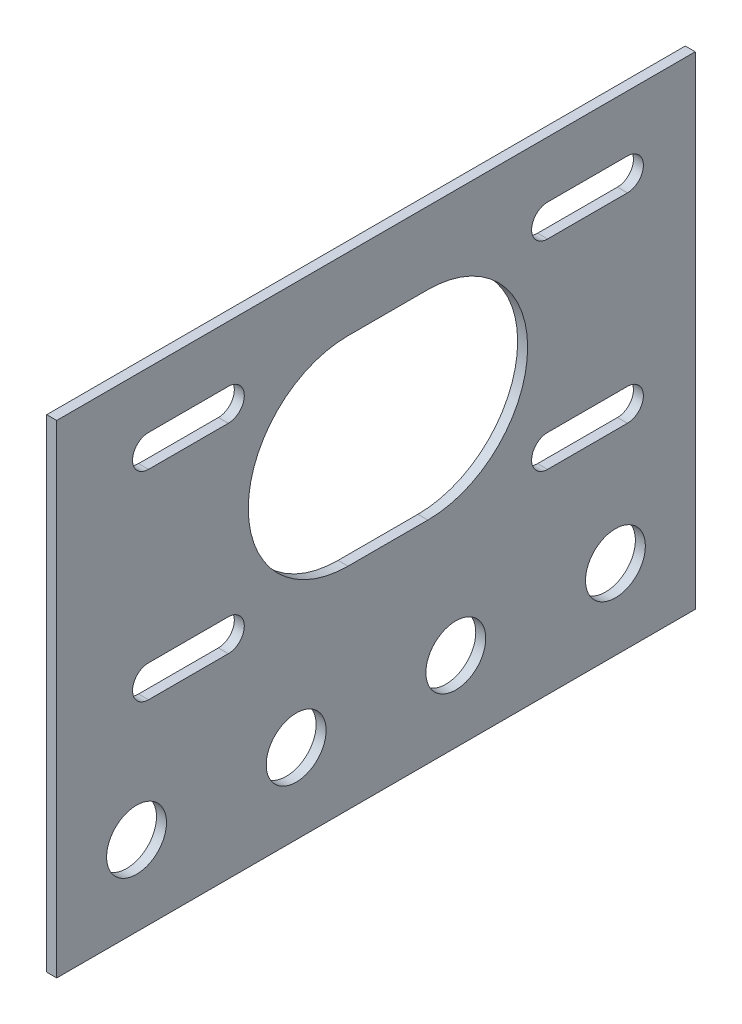
ISO-10303-21;
HEADER;
FILE_DESCRIPTION(('STEP AP214'),'2;1');
FILE_NAME('part.step','',(''),(''),'','','');
FILE_SCHEMA(('AUTOMOTIVE_DESIGN { 1 0 10303 214 1 1 1 1 }'));
ENDSEC;
DATA;
#1=APPLICATION_CONTEXT('core data for automotive mechanical design processes');
#2=APPLICATION_PROTOCOL_DEFINITION('international standard','automotive_design',2000,#1);
#3=PRODUCT_CONTEXT('',#1,'mechanical');
#4=PRODUCT('Part','Part','',(#3));
#5=PRODUCT_RELATED_PRODUCT_CATEGORY('part','',(#4));
#6=PRODUCT_DEFINITION_FORMATION('','',#4);
#7=PRODUCT_DEFINITION_CONTEXT('part definition',#1,'design');
#8=PRODUCT_DEFINITION('design','',#6,#7);
#9=PRODUCT_DEFINITION_SHAPE('','',#8);
#10=(LENGTH_UNIT() NAMED_UNIT(*) SI_UNIT(.MILLI.,.METRE.));
#11=(NAMED_UNIT(*) PLANE_ANGLE_UNIT() SI_UNIT($,.RADIAN.));
#12=(NAMED_UNIT(*) SI_UNIT($,.STERADIAN.) SOLID_ANGLE_UNIT());
#13=UNCERTAINTY_MEASURE_WITH_UNIT(LENGTH_MEASURE(1.E-05),#10,'distance_accuracy_value','');
#14=(GEOMETRIC_REPRESENTATION_CONTEXT(3) GLOBAL_UNCERTAINTY_ASSIGNED_CONTEXT((#13)) GLOBAL_UNIT_ASSIGNED_CONTEXT((#10,
#11,#12)) REPRESENTATION_CONTEXT('',''));
#15=CARTESIAN_POINT('',(0.,0.,0.));
#16=DIRECTION('',(0.,0.,1.));
#17=DIRECTION('',(1.,0.,0.));
#18=AXIS2_PLACEMENT_3D('',#15,#16,#17);
#19=CARTESIAN_POINT('',(1.5875,-38.4175,50.8));
#20=DIRECTION('',(0.,0.,-1.));
#21=DIRECTION('',(-1.,0.,0.));
#22=AXIS2_PLACEMENT_3D('',#19,#20,#21);
#23=PLANE('',#22);
#24=DIRECTION('',(0.,-1.,0.));
#25=VECTOR('',#24,1.);
#26=CARTESIAN_POINT('',(0.,-38.4175,50.8));
#27=LINE('',#26,#25);
#28=CARTESIAN_POINT('',(0.,38.4175,50.8));
#29=VERTEX_POINT('',#28);
#30=CARTESIAN_POINT('',(0.,-38.4175,50.8));
#31=VERTEX_POINT('',#30);
#32=EDGE_CURVE('E454',#29,#31,#27,.T.);
#33=ORIENTED_EDGE('',*,*,#32,.T.);
#34=DIRECTION('',(-1.,0.,0.));
#35=VECTOR('',#34,1.);
#36=CARTESIAN_POINT('',(1.5875,-38.4175,50.8));
#37=LINE('',#36,#35);
#38=CARTESIAN_POINT('',(1.5875,-38.4175,50.8));
#39=VERTEX_POINT('',#38);
#40=EDGE_CURVE('E11',#39,#31,#37,.T.);
#41=ORIENTED_EDGE('',*,*,#40,.F.);
#42=DIRECTION('',(0.,-1.,0.));
#43=VECTOR('',#42,1.);
#44=CARTESIAN_POINT('',(1.5875,-38.4175,50.8));
#45=LINE('',#44,#43);
#46=CARTESIAN_POINT('',(1.5875,38.4175,50.8));
#47=VERTEX_POINT('',#46);
#48=EDGE_CURVE('E458',#47,#39,#45,.T.);
#49=ORIENTED_EDGE('',*,*,#48,.F.);
#50=DIRECTION('',(-1.,0.,0.));
#51=VECTOR('',#50,1.);
#52=CARTESIAN_POINT('',(1.5875,38.4175,50.8));
#53=LINE('',#52,#51);
#54=EDGE_CURVE('E472',#47,#29,#53,.T.);
#55=ORIENTED_EDGE('',*,*,#54,.T.);
#56=EDGE_LOOP('',(#33,#41,#49,#55));
#57=FACE_BOUND('',#56,.T.);
#58=ADVANCED_FACE('F39',(#57),#23,.F.);
#59=CARTESIAN_POINT('',(1.5875,-38.4175,-50.8));
#60=DIRECTION('',(0.,1.,0.));
#61=DIRECTION('',(0.,0.,1.));
#62=AXIS2_PLACEMENT_3D('',#59,#60,#61);
#63=PLANE('',#62);
#64=DIRECTION('',(0.,0.,-1.));
#65=VECTOR('',#64,1.);
#66=CARTESIAN_POINT('',(0.,-38.4175,-50.8));
#67=LINE('',#66,#65);
#68=CARTESIAN_POINT('',(0.,-38.4175,-50.8));
#69=VERTEX_POINT('',#68);
#70=EDGE_CURVE('E476',#31,#69,#67,.T.);
#71=ORIENTED_EDGE('',*,*,#70,.T.);
#72=DIRECTION('',(-1.,0.,0.));
#73=VECTOR('',#72,1.);
#74=CARTESIAN_POINT('',(1.5875,-38.4175,-50.8));
#75=LINE('',#74,#73);
#76=CARTESIAN_POINT('',(1.5875,-38.4175,-50.8));
#77=VERTEX_POINT('',#76);
#78=EDGE_CURVE('E47',#77,#69,#75,.T.);
#79=ORIENTED_EDGE('',*,*,#78,.F.);
#80=DIRECTION('',(0.,0.,-1.));
#81=VECTOR('',#80,1.);
#82=CARTESIAN_POINT('',(1.5875,-38.4175,-50.8));
#83=LINE('',#82,#81);
#84=EDGE_CURVE('E462',#39,#77,#83,.T.);
#85=ORIENTED_EDGE('',*,*,#84,.F.);
#86=ORIENTED_EDGE('',*,*,#40,.T.);
#87=EDGE_LOOP('',(#71,#79,#85,#86));
#88=FACE_BOUND('',#87,.T.);
#89=ADVANCED_FACE('F511',(#88),#63,.F.);
#90=CARTESIAN_POINT('',(1.5875,-38.4175,-50.8));
#91=DIRECTION('',(0.,0.,1.));
#92=DIRECTION('',(1.,0.,0.));
#93=AXIS2_PLACEMENT_3D('',#90,#91,#92);
#94=PLANE('',#93);
#95=DIRECTION('',(0.,1.,0.));
#96=VECTOR('',#95,1.);
#97=CARTESIAN_POINT('',(0.,-38.4175,-50.8));
#98=LINE('',#97,#96);
#99=CARTESIAN_POINT('',(0.,38.4175,-50.8));
#100=VERTEX_POINT('',#99);
#101=EDGE_CURVE('E479',#69,#100,#98,.T.);
#102=ORIENTED_EDGE('',*,*,#101,.T.);
#103=DIRECTION('',(-1.,0.,0.));
#104=VECTOR('',#103,1.);
#105=CARTESIAN_POINT('',(1.5875,38.4175,-50.8));
#106=LINE('',#105,#104);
#107=CARTESIAN_POINT('',(1.5875,38.4175,-50.8));
#108=VERTEX_POINT('',#107);
#109=EDGE_CURVE('E487',#108,#100,#106,.T.);
#110=ORIENTED_EDGE('',*,*,#109,.F.);
#111=DIRECTION('',(0.,1.,0.));
#112=VECTOR('',#111,1.);
#113=CARTESIAN_POINT('',(1.5875,-38.4175,-50.8));
#114=LINE('',#113,#112);
#115=EDGE_CURVE('E466',#77,#108,#114,.T.);
#116=ORIENTED_EDGE('',*,*,#115,.F.);
#117=ORIENTED_EDGE('',*,*,#78,.T.);
#118=EDGE_LOOP('',(#102,#110,#116,#117));
#119=FACE_BOUND('',#118,.T.);
#120=ADVANCED_FACE('F496',(#119),#94,.F.);
#121=CARTESIAN_POINT('',(1.5875,38.4175,-50.8));
#122=DIRECTION('',(0.,-1.,0.));
#123=DIRECTION('',(0.,0.,-1.));
#124=AXIS2_PLACEMENT_3D('',#121,#122,#123);
#125=PLANE('',#124);
#126=DIRECTION('',(0.,0.,1.));
#127=VECTOR('',#126,1.);
#128=CARTESIAN_POINT('',(0.,38.4175,-50.8));
#129=LINE('',#128,#127);
#130=EDGE_CURVE('E463',#100,#29,#129,.T.);
#131=ORIENTED_EDGE('',*,*,#130,.T.);
#132=ORIENTED_EDGE('',*,*,#54,.F.);
#133=DIRECTION('',(0.,0.,1.));
#134=VECTOR('',#133,1.);
#135=CARTESIAN_POINT('',(1.5875,38.4175,-50.8));
#136=LINE('',#135,#134);
#137=EDGE_CURVE('E469',#108,#47,#136,.T.);
#138=ORIENTED_EDGE('',*,*,#137,.F.);
#139=ORIENTED_EDGE('',*,*,#109,.T.);
#140=EDGE_LOOP('',(#131,#132,#138,#139));
#141=FACE_BOUND('',#140,.T.);
#142=ADVANCED_FACE('F504',(#141),#125,.F.);
#143=CARTESIAN_POINT('',(1.5875,0.,0.));
#144=DIRECTION('',(1.,0.,0.));
#145=DIRECTION('',(0.,0.,-1.));
#146=AXIS2_PLACEMENT_3D('',#143,#144,#145);
#147=PLANE('',#146);
#148=CARTESIAN_POINT('',(1.5875,-4.8387,36.195));
#149=DIRECTION('',(1.,0.,0.));
#150=DIRECTION('',(0.,0.,-1.));
#151=AXIS2_PLACEMENT_3D('',#148,#149,#150);
#152=CIRCLE('',#151,2.54);
#153=CARTESIAN_POINT('',(1.5875,-2.2987,36.195));
#154=VERTEX_POINT('',#153);
#155=CARTESIAN_POINT('',(1.5875,-7.3787,36.195));
#156=VERTEX_POINT('',#155);
#157=EDGE_CURVE('E54',#154,#156,#152,.T.);
#158=ORIENTED_EDGE('',*,*,#157,.F.);
#159=DIRECTION('',(0.,0.,1.));
#160=VECTOR('',#159,1.);
#161=CARTESIAN_POINT('',(1.5875,-2.2987,36.195));
#162=LINE('',#161,#160);
#163=CARTESIAN_POINT('',(1.5875,-2.2987,23.495));
#164=VERTEX_POINT('',#163);
#165=EDGE_CURVE('E398',#164,#154,#162,.T.);
#166=ORIENTED_EDGE('',*,*,#165,.F.);
#167=CARTESIAN_POINT('',(1.5875,-4.83869999999999,23.495));
#168=DIRECTION('',(1.,0.,0.));
#169=DIRECTION('',(0.,0.,-1.));
#170=AXIS2_PLACEMENT_3D('',#167,#168,#169);
#171=CIRCLE('',#170,2.54);
#172=CARTESIAN_POINT('',(1.5875,-7.37869999999999,23.495));
#173=VERTEX_POINT('',#172);
#174=EDGE_CURVE('E417',#173,#164,#171,.T.);
#175=ORIENTED_EDGE('',*,*,#174,.F.);
#176=DIRECTION('',(0.,0.,-1.));
#177=VECTOR('',#176,1.);
#178=CARTESIAN_POINT('',(1.5875,-7.3787,36.195));
#179=LINE('',#178,#177);
#180=EDGE_CURVE('E413',#156,#173,#179,.T.);
#181=ORIENTED_EDGE('',*,*,#180,.F.);
#182=EDGE_LOOP('',(#158,#166,#175,#181));
#183=FACE_BOUND('',#182,.T.);
#184=CARTESIAN_POINT('',(1.5875,-25.7175,-38.1));
#185=DIRECTION('',(1.,0.,0.));
#186=DIRECTION('',(0.,0.,-1.));
#187=AXIS2_PLACEMENT_3D('',#184,#185,#186);
#188=CIRCLE('',#187,4.7625);
#189=CARTESIAN_POINT('',(1.5875,-25.7175,-42.8625));
#190=VERTEX_POINT('',#189);
#191=EDGE_CURVE('E388',#190,#190,#188,.T.);
#192=ORIENTED_EDGE('',*,*,#191,.F.);
#193=EDGE_LOOP('',(#192));
#194=FACE_BOUND('',#193,.T.);
#195=CARTESIAN_POINT('',(1.5875,-25.7175,-12.7));
#196=DIRECTION('',(1.,0.,0.));
#197=DIRECTION('',(0.,0.,-1.));
#198=AXIS2_PLACEMENT_3D('',#195,#196,#197);
#199=CIRCLE('',#198,4.7625);
#200=CARTESIAN_POINT('',(1.5875,-25.7175,-17.4625));
#201=VERTEX_POINT('',#200);
#202=EDGE_CURVE('E387',#201,#201,#199,.T.);
#203=ORIENTED_EDGE('',*,*,#202,.F.);
#204=EDGE_LOOP('',(#203));
#205=FACE_BOUND('',#204,.T.);
#206=CARTESIAN_POINT('',(1.5875,-25.7175,12.7));
#207=DIRECTION('',(1.,0.,0.));
#208=DIRECTION('',(0.,0.,-1.));
#209=AXIS2_PLACEMENT_3D('',#206,#207,#208);
#210=CIRCLE('',#209,4.7625);
#211=CARTESIAN_POINT('',(1.5875,-25.7175,7.93750000000001));
#212=VERTEX_POINT('',#211);
#213=EDGE_CURVE('E439',#212,#212,#210,.T.);
#214=ORIENTED_EDGE('',*,*,#213,.F.);
#215=EDGE_LOOP('',(#214));
#216=FACE_BOUND('',#215,.T.);
#217=CARTESIAN_POINT('',(1.5875,-4.83869999999999,-27.305));
#218=DIRECTION('',(1.,0.,0.));
#219=DIRECTION('',(0.,0.,-1.));
#220=AXIS2_PLACEMENT_3D('',#217,#218,#219);
#221=CIRCLE('',#220,2.54);
#222=CARTESIAN_POINT('',(1.5875,-2.29869999999999,-27.305));
#223=VERTEX_POINT('',#222);
#224=CARTESIAN_POINT('',(1.5875,-7.3787,-27.305));
#225=VERTEX_POINT('',#224);
#226=EDGE_CURVE('E62',#223,#225,#221,.T.);
#227=ORIENTED_EDGE('',*,*,#226,.F.);
#228=DIRECTION('',(0.,0.,1.));
#229=VECTOR('',#228,1.);
#230=CARTESIAN_POINT('',(1.5875,-2.29869999999999,-27.305));
#231=LINE('',#230,#229);
#232=CARTESIAN_POINT('',(1.5875,-2.29869999999999,-40.005));
#233=VERTEX_POINT('',#232);
#234=EDGE_CURVE('E224',#233,#223,#231,.T.);
#235=ORIENTED_EDGE('',*,*,#234,.F.);
#236=CARTESIAN_POINT('',(1.5875,-4.8387,-40.005));
#237=DIRECTION('',(1.,0.,0.));
#238=DIRECTION('',(0.,0.,-1.));
#239=AXIS2_PLACEMENT_3D('',#236,#237,#238);
#240=CIRCLE('',#239,2.54);
#241=CARTESIAN_POINT('',(1.5875,-7.3787,-40.005));
#242=VERTEX_POINT('',#241);
#243=EDGE_CURVE('E228',#242,#233,#240,.T.);
#244=ORIENTED_EDGE('',*,*,#243,.F.);
#245=DIRECTION('',(0.,0.,-1.));
#246=VECTOR('',#245,1.);
#247=CARTESIAN_POINT('',(1.5875,-7.3787,-27.305));
#248=LINE('',#247,#246);
#249=EDGE_CURVE('E237',#225,#242,#248,.T.);
#250=ORIENTED_EDGE('',*,*,#249,.F.);
#251=EDGE_LOOP('',(#227,#235,#244,#250));
#252=FACE_BOUND('',#251,.T.);
#253=CARTESIAN_POINT('',(1.5875,26.9113,-27.3049999999999));
#254=DIRECTION('',(1.,0.,0.));
#255=DIRECTION('',(0.,0.,-1.));
#256=AXIS2_PLACEMENT_3D('',#253,#254,#255);
#257=CIRCLE('',#256,2.54);
#258=CARTESIAN_POINT('',(1.5875,29.4513,-27.3049999999999));
#259=VERTEX_POINT('',#258);
#260=CARTESIAN_POINT('',(1.5875,24.3713,-27.3049999999999));
#261=VERTEX_POINT('',#260);
#262=EDGE_CURVE('E270',#259,#261,#257,.T.);
#263=ORIENTED_EDGE('',*,*,#262,.F.);
#264=DIRECTION('',(0.,0.,1.));
#265=VECTOR('',#264,1.);
#266=CARTESIAN_POINT('',(1.5875,29.4513,-27.3049999999999));
#267=LINE('',#266,#265);
#268=CARTESIAN_POINT('',(1.5875,29.4513,-40.0049999999999));
#269=VERTEX_POINT('',#268);
#270=EDGE_CURVE('E257',#269,#259,#267,.T.);
#271=ORIENTED_EDGE('',*,*,#270,.F.);
#272=CARTESIAN_POINT('',(1.5875,26.9113,-40.0049999999999));
#273=DIRECTION('',(1.,0.,0.));
#274=DIRECTION('',(0.,0.,-1.));
#275=AXIS2_PLACEMENT_3D('',#272,#273,#274);
#276=CIRCLE('',#275,2.54);
#277=CARTESIAN_POINT('',(1.5875,24.3713,-40.0049999999999));
#278=VERTEX_POINT('',#277);
#279=EDGE_CURVE('E278',#278,#269,#276,.T.);
#280=ORIENTED_EDGE('',*,*,#279,.F.);
#281=DIRECTION('',(0.,0.,-1.));
#282=VECTOR('',#281,1.);
#283=CARTESIAN_POINT('',(1.5875,24.3713,-27.3049999999999));
#284=LINE('',#283,#282);
#285=EDGE_CURVE('E273',#261,#278,#284,.T.);
#286=ORIENTED_EDGE('',*,*,#285,.F.);
#287=EDGE_LOOP('',(#263,#271,#280,#286));
#288=FACE_BOUND('',#287,.T.);
#289=CARTESIAN_POINT('',(1.5875,26.9113,36.1950000000001));
#290=DIRECTION('',(1.,0.,0.));
#291=DIRECTION('',(0.,0.,-1.));
#292=AXIS2_PLACEMENT_3D('',#289,#290,#291);
#293=CIRCLE('',#292,2.54);
#294=CARTESIAN_POINT('',(1.5875,29.4513,36.1950000000001));
#295=VERTEX_POINT('',#294);
#296=CARTESIAN_POINT('',(1.5875,24.3713,36.1950000000001));
#297=VERTEX_POINT('',#296);
#298=EDGE_CURVE('E314',#295,#297,#293,.T.);
#299=ORIENTED_EDGE('',*,*,#298,.F.);
#300=DIRECTION('',(0.,0.,1.));
#301=VECTOR('',#300,1.);
#302=CARTESIAN_POINT('',(1.5875,29.4513,36.1950000000001));
#303=LINE('',#302,#301);
#304=CARTESIAN_POINT('',(1.5875,29.4513,23.4950000000001));
#305=VERTEX_POINT('',#304);
#306=EDGE_CURVE('E301',#305,#295,#303,.T.);
#307=ORIENTED_EDGE('',*,*,#306,.F.);
#308=CARTESIAN_POINT('',(1.5875,26.9113,23.4950000000001));
#309=DIRECTION('',(1.,0.,0.));
#310=DIRECTION('',(0.,0.,-1.));
#311=AXIS2_PLACEMENT_3D('',#308,#309,#310);
#312=CIRCLE('',#311,2.54);
#313=CARTESIAN_POINT('',(1.5875,24.3713,23.4950000000001));
#314=VERTEX_POINT('',#313);
#315=EDGE_CURVE('E322',#314,#305,#312,.T.);
#316=ORIENTED_EDGE('',*,*,#315,.F.);
#317=DIRECTION('',(0.,0.,-1.));
#318=VECTOR('',#317,1.);
#319=CARTESIAN_POINT('',(1.5875,24.3713,36.1950000000001));
#320=LINE('',#319,#318);
#321=EDGE_CURVE('E317',#297,#314,#320,.T.);
#322=ORIENTED_EDGE('',*,*,#321,.F.);
#323=EDGE_LOOP('',(#299,#307,#316,#322));
#324=FACE_BOUND('',#323,.T.);
#325=CARTESIAN_POINT('',(1.5875,11.0363,4.44500000000007));
#326=DIRECTION('',(1.,0.,0.));
#327=DIRECTION('',(0.,0.,-1.));
#328=AXIS2_PLACEMENT_3D('',#325,#326,#327);
#329=CIRCLE('',#328,15.875);
#330=CARTESIAN_POINT('',(1.5875,26.9113,4.44500000000007));
#331=VERTEX_POINT('',#330);
#332=CARTESIAN_POINT('',(1.5875,-4.83869999999999,4.44500000000007));
#333=VERTEX_POINT('',#332);
#334=EDGE_CURVE('E358',#331,#333,#329,.T.);
#335=ORIENTED_EDGE('',*,*,#334,.F.);
#336=DIRECTION('',(0.,0.,1.));
#337=VECTOR('',#336,1.);
#338=CARTESIAN_POINT('',(1.5875,26.9113,4.44500000000007));
#339=LINE('',#338,#337);
#340=CARTESIAN_POINT('',(1.5875,26.9113,-8.25499999999993));
#341=VERTEX_POINT('',#340);
#342=EDGE_CURVE('E345',#341,#331,#339,.T.);
#343=ORIENTED_EDGE('',*,*,#342,.F.);
#344=CARTESIAN_POINT('',(1.5875,11.0363,-8.25499999999993));
#345=DIRECTION('',(1.,0.,0.));
#346=DIRECTION('',(0.,0.,-1.));
#347=AXIS2_PLACEMENT_3D('',#344,#345,#346);
#348=CIRCLE('',#347,15.875);
#349=CARTESIAN_POINT('',(1.5875,-4.83869999999998,-8.25499999999993));
#350=VERTEX_POINT('',#349);
#351=EDGE_CURVE('E365',#350,#341,#348,.T.);
#352=ORIENTED_EDGE('',*,*,#351,.F.);
#353=DIRECTION('',(0.,0.,-1.));
#354=VECTOR('',#353,1.);
#355=CARTESIAN_POINT('',(1.5875,-4.83869999999999,4.44500000000007));
#356=LINE('',#355,#354);
#357=EDGE_CURVE('E361',#333,#350,#356,.T.);
#358=ORIENTED_EDGE('',*,*,#357,.F.);
#359=EDGE_LOOP('',(#335,#343,#352,#358));
#360=FACE_BOUND('',#359,.T.);
#361=CARTESIAN_POINT('',(1.5875,-25.7175,38.1));
#362=DIRECTION('',(1.,0.,0.));
#363=DIRECTION('',(0.,0.,-1.));
#364=AXIS2_PLACEMENT_3D('',#361,#362,#363);
#365=CIRCLE('',#364,4.7625);
#366=CARTESIAN_POINT('',(1.5875,-25.7175,33.3375));
#367=VERTEX_POINT('',#366);
#368=EDGE_CURVE('E438',#367,#367,#365,.T.);
#369=ORIENTED_EDGE('',*,*,#368,.F.);
#370=EDGE_LOOP('',(#369));
#371=FACE_BOUND('',#370,.T.);
#372=ORIENTED_EDGE('',*,*,#48,.T.);
#373=ORIENTED_EDGE('',*,*,#84,.T.);
#374=ORIENTED_EDGE('',*,*,#115,.T.);
#375=ORIENTED_EDGE('',*,*,#137,.T.);
#376=EDGE_LOOP('',(#372,#373,#374,#375));
#377=FACE_BOUND('',#376,.T.);
#378=ADVANCED_FACE('F510',(#183,#194,#205,#216,#252,#288,#324,#360,#371,#377),#147,.T.);
#379=CARTESIAN_POINT('',(0.,0.,0.));
#380=DIRECTION('',(1.,0.,0.));
#381=DIRECTION('',(0.,0.,-1.));
#382=AXIS2_PLACEMENT_3D('',#379,#380,#381);
#383=PLANE('',#382);
#384=DIRECTION('',(0.,0.,1.));
#385=VECTOR('',#384,1.);
#386=CARTESIAN_POINT('',(0.,-2.2987,36.195));
#387=LINE('',#386,#385);
#388=CARTESIAN_POINT('',(0.,-2.2987,23.495));
#389=VERTEX_POINT('',#388);
#390=CARTESIAN_POINT('',(0.,-2.2987,36.195));
#391=VERTEX_POINT('',#390);
#392=EDGE_CURVE('E406',#389,#391,#387,.T.);
#393=ORIENTED_EDGE('',*,*,#392,.T.);
#394=CARTESIAN_POINT('',(0.,-4.8387,36.195));
#395=DIRECTION('',(1.,0.,0.));
#396=DIRECTION('',(0.,0.,-1.));
#397=AXIS2_PLACEMENT_3D('',#394,#395,#396);
#398=CIRCLE('',#397,2.54);
#399=CARTESIAN_POINT('',(0.,-7.3787,36.195));
#400=VERTEX_POINT('',#399);
#401=EDGE_CURVE('E393',#391,#400,#398,.T.);
#402=ORIENTED_EDGE('',*,*,#401,.T.);
#403=DIRECTION('',(0.,0.,-1.));
#404=VECTOR('',#403,1.);
#405=CARTESIAN_POINT('',(0.,-7.3787,36.195));
#406=LINE('',#405,#404);
#407=CARTESIAN_POINT('',(0.,-7.3787,23.495));
#408=VERTEX_POINT('',#407);
#409=EDGE_CURVE('E397',#400,#408,#406,.T.);
#410=ORIENTED_EDGE('',*,*,#409,.T.);
#411=CARTESIAN_POINT('',(0.,-4.83869999999999,23.495));
#412=DIRECTION('',(1.,0.,0.));
#413=DIRECTION('',(0.,0.,-1.));
#414=AXIS2_PLACEMENT_3D('',#411,#412,#413);
#415=CIRCLE('',#414,2.54);
#416=EDGE_CURVE('E402',#408,#389,#415,.T.);
#417=ORIENTED_EDGE('',*,*,#416,.T.);
#418=EDGE_LOOP('',(#393,#402,#410,#417));
#419=FACE_BOUND('',#418,.T.);
#420=CARTESIAN_POINT('',(0.,-25.7175,-38.1));
#421=DIRECTION('',(1.,0.,0.));
#422=DIRECTION('',(0.,0.,-1.));
#423=AXIS2_PLACEMENT_3D('',#420,#421,#422);
#424=CIRCLE('',#423,4.7625);
#425=CARTESIAN_POINT('',(0.,-25.7175,-42.8625));
#426=VERTEX_POINT('',#425);
#427=EDGE_CURVE('E383',#426,#426,#424,.T.);
#428=ORIENTED_EDGE('',*,*,#427,.T.);
#429=EDGE_LOOP('',(#428));
#430=FACE_BOUND('',#429,.T.);
#431=CARTESIAN_POINT('',(0.,-25.7175,-12.7));
#432=DIRECTION('',(1.,0.,0.));
#433=DIRECTION('',(0.,0.,-1.));
#434=AXIS2_PLACEMENT_3D('',#431,#432,#433);
#435=CIRCLE('',#434,4.7625);
#436=CARTESIAN_POINT('',(0.,-25.7175,-17.4625));
#437=VERTEX_POINT('',#436);
#438=EDGE_CURVE('E443',#437,#437,#435,.T.);
#439=ORIENTED_EDGE('',*,*,#438,.T.);
#440=EDGE_LOOP('',(#439));
#441=FACE_BOUND('',#440,.T.);
#442=CARTESIAN_POINT('',(0.,-25.7175,12.7));
#443=DIRECTION('',(1.,0.,0.));
#444=DIRECTION('',(0.,0.,-1.));
#445=AXIS2_PLACEMENT_3D('',#442,#443,#444);
#446=CIRCLE('',#445,4.7625);
#447=CARTESIAN_POINT('',(0.,-25.7175,7.93750000000001));
#448=VERTEX_POINT('',#447);
#449=EDGE_CURVE('E434',#448,#448,#446,.T.);
#450=ORIENTED_EDGE('',*,*,#449,.T.);
#451=EDGE_LOOP('',(#450));
#452=FACE_BOUND('',#451,.T.);
#453=DIRECTION('',(0.,0.,1.));
#454=VECTOR('',#453,1.);
#455=CARTESIAN_POINT('',(0.,-2.29869999999999,-27.305));
#456=LINE('',#455,#454);
#457=CARTESIAN_POINT('',(0.,-2.29869999999999,-40.005));
#458=VERTEX_POINT('',#457);
#459=CARTESIAN_POINT('',(0.,-2.29869999999999,-27.305));
#460=VERTEX_POINT('',#459);
#461=EDGE_CURVE('E209',#458,#460,#456,.T.);
#462=ORIENTED_EDGE('',*,*,#461,.T.);
#463=CARTESIAN_POINT('',(0.,-4.83869999999999,-27.305));
#464=DIRECTION('',(1.,0.,0.));
#465=DIRECTION('',(0.,0.,-1.));
#466=AXIS2_PLACEMENT_3D('',#463,#464,#465);
#467=CIRCLE('',#466,2.54);
#468=CARTESIAN_POINT('',(0.,-7.3787,-27.305));
#469=VERTEX_POINT('',#468);
#470=EDGE_CURVE('E202',#460,#469,#467,.T.);
#471=ORIENTED_EDGE('',*,*,#470,.T.);
#472=DIRECTION('',(0.,0.,-1.));
#473=VECTOR('',#472,1.);
#474=CARTESIAN_POINT('',(0.,-7.3787,-27.305));
#475=LINE('',#474,#473);
#476=CARTESIAN_POINT('',(0.,-7.3787,-40.005));
#477=VERTEX_POINT('',#476);
#478=EDGE_CURVE('E213',#469,#477,#475,.T.);
#479=ORIENTED_EDGE('',*,*,#478,.T.);
#480=CARTESIAN_POINT('',(0.,-4.8387,-40.005));
#481=DIRECTION('',(1.,0.,0.));
#482=DIRECTION('',(0.,0.,-1.));
#483=AXIS2_PLACEMENT_3D('',#480,#481,#482);
#484=CIRCLE('',#483,2.54);
#485=EDGE_CURVE('E218',#477,#458,#484,.T.);
#486=ORIENTED_EDGE('',*,*,#485,.T.);
#487=EDGE_LOOP('',(#462,#471,#479,#486));
#488=FACE_BOUND('',#487,.T.);
#489=DIRECTION('',(0.,0.,1.));
#490=VECTOR('',#489,1.);
#491=CARTESIAN_POINT('',(0.,29.4513,-27.3049999999999));
#492=LINE('',#491,#490);
#493=CARTESIAN_POINT('',(0.,29.4513,-40.0049999999999));
#494=VERTEX_POINT('',#493);
#495=CARTESIAN_POINT('',(0.,29.4513,-27.3049999999999));
#496=VERTEX_POINT('',#495);
#497=EDGE_CURVE('E265',#494,#496,#492,.T.);
#498=ORIENTED_EDGE('',*,*,#497,.T.);
#499=CARTESIAN_POINT('',(0.,26.9113,-27.3049999999999));
#500=DIRECTION('',(1.,0.,0.));
#501=DIRECTION('',(0.,0.,-1.));
#502=AXIS2_PLACEMENT_3D('',#499,#500,#501);
#503=CIRCLE('',#502,2.54);
#504=CARTESIAN_POINT('',(0.,24.3713,-27.3049999999999));
#505=VERTEX_POINT('',#504);
#506=EDGE_CURVE('E252',#496,#505,#503,.T.);
#507=ORIENTED_EDGE('',*,*,#506,.T.);
#508=DIRECTION('',(0.,0.,-1.));
#509=VECTOR('',#508,1.);
#510=CARTESIAN_POINT('',(0.,24.3713,-27.3049999999999));
#511=LINE('',#510,#509);
#512=CARTESIAN_POINT('',(0.,24.3713,-40.0049999999999));
#513=VERTEX_POINT('',#512);
#514=EDGE_CURVE('E256',#505,#513,#511,.T.);
#515=ORIENTED_EDGE('',*,*,#514,.T.);
#516=CARTESIAN_POINT('',(0.,26.9113,-40.0049999999999));
#517=DIRECTION('',(1.,0.,0.));
#518=DIRECTION('',(0.,0.,-1.));
#519=AXIS2_PLACEMENT_3D('',#516,#517,#518);
#520=CIRCLE('',#519,2.54);
#521=EDGE_CURVE('E261',#513,#494,#520,.T.);
#522=ORIENTED_EDGE('',*,*,#521,.T.);
#523=EDGE_LOOP('',(#498,#507,#515,#522));
#524=FACE_BOUND('',#523,.T.);
#525=DIRECTION('',(0.,0.,1.));
#526=VECTOR('',#525,1.);
#527=CARTESIAN_POINT('',(0.,29.4513,36.1950000000001));
#528=LINE('',#527,#526);
#529=CARTESIAN_POINT('',(0.,29.4513,23.4950000000001));
#530=VERTEX_POINT('',#529);
#531=CARTESIAN_POINT('',(0.,29.4513,36.1950000000001));
#532=VERTEX_POINT('',#531);
#533=EDGE_CURVE('E309',#530,#532,#528,.T.);
#534=ORIENTED_EDGE('',*,*,#533,.T.);
#535=CARTESIAN_POINT('',(0.,26.9113,36.1950000000001));
#536=DIRECTION('',(1.,0.,0.));
#537=DIRECTION('',(0.,0.,-1.));
#538=AXIS2_PLACEMENT_3D('',#535,#536,#537);
#539=CIRCLE('',#538,2.54);
#540=CARTESIAN_POINT('',(0.,24.3713,36.1950000000001));
#541=VERTEX_POINT('',#540);
#542=EDGE_CURVE('E296',#532,#541,#539,.T.);
#543=ORIENTED_EDGE('',*,*,#542,.T.);
#544=DIRECTION('',(0.,0.,-1.));
#545=VECTOR('',#544,1.);
#546=CARTESIAN_POINT('',(0.,24.3713,36.1950000000001));
#547=LINE('',#546,#545);
#548=CARTESIAN_POINT('',(0.,24.3713,23.4950000000001));
#549=VERTEX_POINT('',#548);
#550=EDGE_CURVE('E300',#541,#549,#547,.T.);
#551=ORIENTED_EDGE('',*,*,#550,.T.);
#552=CARTESIAN_POINT('',(0.,26.9113,23.4950000000001));
#553=DIRECTION('',(1.,0.,0.));
#554=DIRECTION('',(0.,0.,-1.));
#555=AXIS2_PLACEMENT_3D('',#552,#553,#554);
#556=CIRCLE('',#555,2.54);
#557=EDGE_CURVE('E305',#549,#530,#556,.T.);
#558=ORIENTED_EDGE('',*,*,#557,.T.);
#559=EDGE_LOOP('',(#534,#543,#551,#558));
#560=FACE_BOUND('',#559,.T.);
#561=DIRECTION('',(0.,0.,1.));
#562=VECTOR('',#561,1.);
#563=CARTESIAN_POINT('',(0.,26.9113,4.44500000000007));
#564=LINE('',#563,#562);
#565=CARTESIAN_POINT('',(0.,26.9113,-8.25499999999993));
#566=VERTEX_POINT('',#565);
#567=CARTESIAN_POINT('',(0.,26.9113,4.44500000000007));
#568=VERTEX_POINT('',#567);
#569=EDGE_CURVE('E353',#566,#568,#564,.T.);
#570=ORIENTED_EDGE('',*,*,#569,.T.);
#571=CARTESIAN_POINT('',(0.,11.0363,4.44500000000007));
#572=DIRECTION('',(1.,0.,0.));
#573=DIRECTION('',(0.,0.,-1.));
#574=AXIS2_PLACEMENT_3D('',#571,#572,#573);
#575=CIRCLE('',#574,15.875);
#576=CARTESIAN_POINT('',(0.,-4.83869999999999,4.44500000000007));
#577=VERTEX_POINT('',#576);
#578=EDGE_CURVE('E340',#568,#577,#575,.T.);
#579=ORIENTED_EDGE('',*,*,#578,.T.);
#580=DIRECTION('',(0.,0.,-1.));
#581=VECTOR('',#580,1.);
#582=CARTESIAN_POINT('',(0.,-4.83869999999999,4.44500000000007));
#583=LINE('',#582,#581);
#584=CARTESIAN_POINT('',(0.,-4.83869999999999,-8.25499999999993));
#585=VERTEX_POINT('',#584);
#586=EDGE_CURVE('E344',#577,#585,#583,.T.);
#587=ORIENTED_EDGE('',*,*,#586,.T.);
#588=CARTESIAN_POINT('',(0.,11.0363,-8.25499999999993));
#589=DIRECTION('',(1.,0.,0.));
#590=DIRECTION('',(0.,0.,-1.));
#591=AXIS2_PLACEMENT_3D('',#588,#589,#590);
#592=CIRCLE('',#591,15.875);
#593=EDGE_CURVE('E349',#585,#566,#592,.T.);
#594=ORIENTED_EDGE('',*,*,#593,.T.);
#595=EDGE_LOOP('',(#570,#579,#587,#594));
#596=FACE_BOUND('',#595,.T.);
#597=CARTESIAN_POINT('',(0.,-25.7175,38.1));
#598=DIRECTION('',(1.,0.,0.));
#599=DIRECTION('',(0.,0.,-1.));
#600=AXIS2_PLACEMENT_3D('',#597,#598,#599);
#601=CIRCLE('',#600,4.7625);
#602=CARTESIAN_POINT('',(0.,-25.7175,33.3375));
#603=VERTEX_POINT('',#602);
#604=EDGE_CURVE('E450',#603,#603,#601,.T.);
#605=ORIENTED_EDGE('',*,*,#604,.T.);
#606=EDGE_LOOP('',(#605));
#607=FACE_BOUND('',#606,.T.);
#608=ORIENTED_EDGE('',*,*,#32,.F.);
#609=ORIENTED_EDGE('',*,*,#130,.F.);
#610=ORIENTED_EDGE('',*,*,#101,.F.);
#611=ORIENTED_EDGE('',*,*,#70,.F.);
#612=EDGE_LOOP('',(#608,#609,#610,#611));
#613=FACE_BOUND('',#612,.T.);
#614=ADVANCED_FACE('F220',(#419,#430,#441,#452,#488,#524,#560,#596,#607,#613),#383,.F.);
#615=CARTESIAN_POINT('',(0.,-25.7175,38.1));
#616=DIRECTION('',(1.,0.,0.));
#617=DIRECTION('',(0.,0.,-1.));
#618=AXIS2_PLACEMENT_3D('',#615,#616,#617);
#619=CYLINDRICAL_SURFACE('',#618,4.7625);
#620=ORIENTED_EDGE('',*,*,#604,.F.);
#621=EDGE_LOOP('',(#620));
#622=FACE_BOUND('',#621,.T.);
#623=ORIENTED_EDGE('',*,*,#368,.T.);
#624=EDGE_LOOP('',(#623));
#625=FACE_BOUND('',#624,.T.);
#626=ADVANCED_FACE('F523',(#622,#625),#619,.F.);
#627=CARTESIAN_POINT('',(0.,11.0363,4.44500000000007));
#628=DIRECTION('',(1.,0.,0.));
#629=DIRECTION('',(0.,0.,-1.));
#630=AXIS2_PLACEMENT_3D('',#627,#628,#629);
#631=CYLINDRICAL_SURFACE('',#630,15.875);
#632=ORIENTED_EDGE('',*,*,#334,.T.);
#633=DIRECTION('',(1.,0.,0.));
#634=VECTOR('',#633,1.);
#635=CARTESIAN_POINT('',(0.,-4.83869999999999,4.44500000000007));
#636=LINE('',#635,#634);
#637=EDGE_CURVE('E357',#577,#333,#636,.T.);
#638=ORIENTED_EDGE('',*,*,#637,.F.);
#639=ORIENTED_EDGE('',*,*,#578,.F.);
#640=DIRECTION('',(1.,0.,0.));
#641=VECTOR('',#640,1.);
#642=CARTESIAN_POINT('',(0.,26.9113,4.44500000000007));
#643=LINE('',#642,#641);
#644=EDGE_CURVE('E318',#568,#331,#643,.T.);
#645=ORIENTED_EDGE('',*,*,#644,.T.);
#646=EDGE_LOOP('',(#632,#638,#639,#645));
#647=FACE_BOUND('',#646,.T.);
#648=ADVANCED_FACE('F530',(#647),#631,.F.);
#649=CARTESIAN_POINT('',(0.,26.9113,4.44500000000007));
#650=DIRECTION('',(0.,1.,0.));
#651=DIRECTION('',(0.,0.,1.));
#652=AXIS2_PLACEMENT_3D('',#649,#650,#651);
#653=PLANE('',#652);
#654=ORIENTED_EDGE('',*,*,#342,.T.);
#655=ORIENTED_EDGE('',*,*,#644,.F.);
#656=ORIENTED_EDGE('',*,*,#569,.F.);
#657=DIRECTION('',(1.,0.,0.));
#658=VECTOR('',#657,1.);
#659=CARTESIAN_POINT('',(0.,26.9113,-8.25499999999993));
#660=LINE('',#659,#658);
#661=EDGE_CURVE('E374',#566,#341,#660,.T.);
#662=ORIENTED_EDGE('',*,*,#661,.T.);
#663=EDGE_LOOP('',(#654,#655,#656,#662));
#664=FACE_BOUND('',#663,.T.);
#665=ADVANCED_FACE('F561',(#664),#653,.F.);
#666=CARTESIAN_POINT('',(0.,11.0363,-8.25499999999993));
#667=DIRECTION('',(1.,0.,0.));
#668=DIRECTION('',(0.,0.,-1.));
#669=AXIS2_PLACEMENT_3D('',#666,#667,#668);
#670=CYLINDRICAL_SURFACE('',#669,15.875);
#671=ORIENTED_EDGE('',*,*,#351,.T.);
#672=ORIENTED_EDGE('',*,*,#661,.F.);
#673=ORIENTED_EDGE('',*,*,#593,.F.);
#674=DIRECTION('',(1.,0.,0.));
#675=VECTOR('',#674,1.);
#676=CARTESIAN_POINT('',(0.,-4.83869999999998,-8.25499999999993));
#677=LINE('',#676,#675);
#678=EDGE_CURVE('E377',#585,#350,#677,.T.);
#679=ORIENTED_EDGE('',*,*,#678,.T.);
#680=EDGE_LOOP('',(#671,#672,#673,#679));
#681=FACE_BOUND('',#680,.T.);
#682=ADVANCED_FACE('F567',(#681),#670,.F.);
#683=CARTESIAN_POINT('',(0.,-4.83869999999999,4.44500000000007));
#684=DIRECTION('',(0.,-1.,0.));
#685=DIRECTION('',(0.,0.,-1.));
#686=AXIS2_PLACEMENT_3D('',#683,#684,#685);
#687=PLANE('',#686);
#688=ORIENTED_EDGE('',*,*,#357,.T.);
#689=ORIENTED_EDGE('',*,*,#678,.F.);
#690=ORIENTED_EDGE('',*,*,#586,.F.);
#691=ORIENTED_EDGE('',*,*,#637,.T.);
#692=EDGE_LOOP('',(#688,#689,#690,#691));
#693=FACE_BOUND('',#692,.T.);
#694=ADVANCED_FACE('F563',(#693),#687,.F.);
#695=CARTESIAN_POINT('',(0.,26.9113,36.1950000000001));
#696=DIRECTION('',(1.,0.,0.));
#697=DIRECTION('',(0.,0.,-1.));
#698=AXIS2_PLACEMENT_3D('',#695,#696,#697);
#699=CYLINDRICAL_SURFACE('',#698,2.54);
#700=ORIENTED_EDGE('',*,*,#298,.T.);
#701=DIRECTION('',(1.,0.,0.));
#702=VECTOR('',#701,1.);
#703=CARTESIAN_POINT('',(0.,24.3713,36.1950000000001));
#704=LINE('',#703,#702);
#705=EDGE_CURVE('E313',#541,#297,#704,.T.);
#706=ORIENTED_EDGE('',*,*,#705,.F.);
#707=ORIENTED_EDGE('',*,*,#542,.F.);
#708=DIRECTION('',(1.,0.,0.));
#709=VECTOR('',#708,1.);
#710=CARTESIAN_POINT('',(0.,29.4513,36.1950000000001));
#711=LINE('',#710,#709);
#712=EDGE_CURVE('E274',#532,#295,#711,.T.);
#713=ORIENTED_EDGE('',*,*,#712,.T.);
#714=EDGE_LOOP('',(#700,#706,#707,#713));
#715=FACE_BOUND('',#714,.T.);
#716=ADVANCED_FACE('F566',(#715),#699,.F.);
#717=CARTESIAN_POINT('',(0.,29.4513,36.1950000000001));
#718=DIRECTION('',(0.,1.,0.));
#719=DIRECTION('',(0.,0.,1.));
#720=AXIS2_PLACEMENT_3D('',#717,#718,#719);
#721=PLANE('',#720);
#722=ORIENTED_EDGE('',*,*,#306,.T.);
#723=ORIENTED_EDGE('',*,*,#712,.F.);
#724=ORIENTED_EDGE('',*,*,#533,.F.);
#725=DIRECTION('',(1.,0.,0.));
#726=VECTOR('',#725,1.);
#727=CARTESIAN_POINT('',(0.,29.4513,23.4950000000001));
#728=LINE('',#727,#726);
#729=EDGE_CURVE('E331',#530,#305,#728,.T.);
#730=ORIENTED_EDGE('',*,*,#729,.T.);
#731=EDGE_LOOP('',(#722,#723,#724,#730));
#732=FACE_BOUND('',#731,.T.);
#733=ADVANCED_FACE('F577',(#732),#721,.F.);
#734=CARTESIAN_POINT('',(0.,26.9113,23.4950000000001));
#735=DIRECTION('',(1.,0.,0.));
#736=DIRECTION('',(0.,0.,-1.));
#737=AXIS2_PLACEMENT_3D('',#734,#735,#736);
#738=CYLINDRICAL_SURFACE('',#737,2.54);
#739=ORIENTED_EDGE('',*,*,#315,.T.);
#740=ORIENTED_EDGE('',*,*,#729,.F.);
#741=ORIENTED_EDGE('',*,*,#557,.F.);
#742=DIRECTION('',(1.,0.,0.));
#743=VECTOR('',#742,1.);
#744=CARTESIAN_POINT('',(0.,24.3713,23.4950000000001));
#745=LINE('',#744,#743);
#746=EDGE_CURVE('E334',#549,#314,#745,.T.);
#747=ORIENTED_EDGE('',*,*,#746,.T.);
#748=EDGE_LOOP('',(#739,#740,#741,#747));
#749=FACE_BOUND('',#748,.T.);
#750=ADVANCED_FACE('F583',(#749),#738,.F.);
#751=CARTESIAN_POINT('',(0.,24.3713,36.1950000000001));
#752=DIRECTION('',(0.,-1.,0.));
#753=DIRECTION('',(0.,0.,-1.));
#754=AXIS2_PLACEMENT_3D('',#751,#752,#753);
#755=PLANE('',#754);
#756=ORIENTED_EDGE('',*,*,#321,.T.);
#757=ORIENTED_EDGE('',*,*,#746,.F.);
#758=ORIENTED_EDGE('',*,*,#550,.F.);
#759=ORIENTED_EDGE('',*,*,#705,.T.);
#760=EDGE_LOOP('',(#756,#757,#758,#759));
#761=FACE_BOUND('',#760,.T.);
#762=ADVANCED_FACE('F579',(#761),#755,.F.);
#763=CARTESIAN_POINT('',(0.,26.9113,-27.3049999999999));
#764=DIRECTION('',(1.,0.,0.));
#765=DIRECTION('',(0.,0.,-1.));
#766=AXIS2_PLACEMENT_3D('',#763,#764,#765);
#767=CYLINDRICAL_SURFACE('',#766,2.54);
#768=ORIENTED_EDGE('',*,*,#262,.T.);
#769=DIRECTION('',(1.,0.,0.));
#770=VECTOR('',#769,1.);
#771=CARTESIAN_POINT('',(0.,24.3713,-27.3049999999999));
#772=LINE('',#771,#770);
#773=EDGE_CURVE('E269',#505,#261,#772,.T.);
#774=ORIENTED_EDGE('',*,*,#773,.F.);
#775=ORIENTED_EDGE('',*,*,#506,.F.);
#776=DIRECTION('',(1.,0.,0.));
#777=VECTOR('',#776,1.);
#778=CARTESIAN_POINT('',(0.,29.4513,-27.3049999999999));
#779=LINE('',#778,#777);
#780=EDGE_CURVE('E238',#496,#259,#779,.T.);
#781=ORIENTED_EDGE('',*,*,#780,.T.);
#782=EDGE_LOOP('',(#768,#774,#775,#781));
#783=FACE_BOUND('',#782,.T.);
#784=ADVANCED_FACE('F582',(#783),#767,.F.);
#785=CARTESIAN_POINT('',(0.,29.4513,-27.3049999999999));
#786=DIRECTION('',(0.,1.,0.));
#787=DIRECTION('',(0.,0.,1.));
#788=AXIS2_PLACEMENT_3D('',#785,#786,#787);
#789=PLANE('',#788);
#790=ORIENTED_EDGE('',*,*,#270,.T.);
#791=ORIENTED_EDGE('',*,*,#780,.F.);
#792=ORIENTED_EDGE('',*,*,#497,.F.);
#793=DIRECTION('',(1.,0.,0.));
#794=VECTOR('',#793,1.);
#795=CARTESIAN_POINT('',(0.,29.4513,-40.0049999999999));
#796=LINE('',#795,#794);
#797=EDGE_CURVE('E287',#494,#269,#796,.T.);
#798=ORIENTED_EDGE('',*,*,#797,.T.);
#799=EDGE_LOOP('',(#790,#791,#792,#798));
#800=FACE_BOUND('',#799,.T.);
#801=ADVANCED_FACE('F593',(#800),#789,.F.);
#802=CARTESIAN_POINT('',(0.,26.9113,-40.0049999999999));
#803=DIRECTION('',(1.,0.,0.));
#804=DIRECTION('',(0.,0.,-1.));
#805=AXIS2_PLACEMENT_3D('',#802,#803,#804);
#806=CYLINDRICAL_SURFACE('',#805,2.54);
#807=ORIENTED_EDGE('',*,*,#279,.T.);
#808=ORIENTED_EDGE('',*,*,#797,.F.);
#809=ORIENTED_EDGE('',*,*,#521,.F.);
#810=DIRECTION('',(1.,0.,0.));
#811=VECTOR('',#810,1.);
#812=CARTESIAN_POINT('',(0.,24.3713,-40.0049999999999));
#813=LINE('',#812,#811);
#814=EDGE_CURVE('E290',#513,#278,#813,.T.);
#815=ORIENTED_EDGE('',*,*,#814,.T.);
#816=EDGE_LOOP('',(#807,#808,#809,#815));
#817=FACE_BOUND('',#816,.T.);
#818=ADVANCED_FACE('F598',(#817),#806,.F.);
#819=CARTESIAN_POINT('',(0.,24.3713,-27.3049999999999));
#820=DIRECTION('',(0.,-1.,0.));
#821=DIRECTION('',(0.,0.,-1.));
#822=AXIS2_PLACEMENT_3D('',#819,#820,#821);
#823=PLANE('',#822);
#824=ORIENTED_EDGE('',*,*,#285,.T.);
#825=ORIENTED_EDGE('',*,*,#814,.F.);
#826=ORIENTED_EDGE('',*,*,#514,.F.);
#827=ORIENTED_EDGE('',*,*,#773,.T.);
#828=EDGE_LOOP('',(#824,#825,#826,#827));
#829=FACE_BOUND('',#828,.T.);
#830=ADVANCED_FACE('F595',(#829),#823,.F.);
#831=CARTESIAN_POINT('',(0.,-4.83869999999999,-27.305));
#832=DIRECTION('',(1.,0.,0.));
#833=DIRECTION('',(0.,0.,-1.));
#834=AXIS2_PLACEMENT_3D('',#831,#832,#833);
#835=CYLINDRICAL_SURFACE('',#834,2.54);
#836=ORIENTED_EDGE('',*,*,#226,.T.);
#837=DIRECTION('',(1.,0.,0.));
#838=VECTOR('',#837,1.);
#839=CARTESIAN_POINT('',(0.,-7.3787,-27.305));
#840=LINE('',#839,#838);
#841=EDGE_CURVE('E198',#469,#225,#840,.T.);
#842=ORIENTED_EDGE('',*,*,#841,.F.);
#843=ORIENTED_EDGE('',*,*,#470,.F.);
#844=DIRECTION('',(1.,0.,0.));
#845=VECTOR('',#844,1.);
#846=CARTESIAN_POINT('',(0.,-2.29869999999999,-27.305));
#847=LINE('',#846,#845);
#848=EDGE_CURVE('E244',#460,#223,#847,.T.);
#849=ORIENTED_EDGE('',*,*,#848,.T.);
#850=EDGE_LOOP('',(#836,#842,#843,#849));
#851=FACE_BOUND('',#850,.T.);
#852=ADVANCED_FACE('F200',(#851),#835,.F.);
#853=CARTESIAN_POINT('',(0.,-2.29869999999999,-27.305));
#854=DIRECTION('',(0.,1.,0.));
#855=DIRECTION('',(0.,0.,1.));
#856=AXIS2_PLACEMENT_3D('',#853,#854,#855);
#857=PLANE('',#856);
#858=ORIENTED_EDGE('',*,*,#234,.T.);
#859=ORIENTED_EDGE('',*,*,#848,.F.);
#860=ORIENTED_EDGE('',*,*,#461,.F.);
#861=DIRECTION('',(1.,0.,0.));
#862=VECTOR('',#861,1.);
#863=CARTESIAN_POINT('',(0.,-2.29869999999999,-40.005));
#864=LINE('',#863,#862);
#865=EDGE_CURVE('E247',#458,#233,#864,.T.);
#866=ORIENTED_EDGE('',*,*,#865,.T.);
#867=EDGE_LOOP('',(#858,#859,#860,#866));
#868=FACE_BOUND('',#867,.T.);
#869=ADVANCED_FACE('F608',(#868),#857,.F.);
#870=CARTESIAN_POINT('',(0.,-4.8387,-40.005));
#871=DIRECTION('',(1.,0.,0.));
#872=DIRECTION('',(0.,0.,-1.));
#873=AXIS2_PLACEMENT_3D('',#870,#871,#872);
#874=CYLINDRICAL_SURFACE('',#873,2.54);
#875=ORIENTED_EDGE('',*,*,#243,.T.);
#876=ORIENTED_EDGE('',*,*,#865,.F.);
#877=ORIENTED_EDGE('',*,*,#485,.F.);
#878=DIRECTION('',(1.,0.,0.));
#879=VECTOR('',#878,1.);
#880=CARTESIAN_POINT('',(0.,-7.3787,-40.005));
#881=LINE('',#880,#879);
#882=EDGE_CURVE('E208',#477,#242,#881,.T.);
#883=ORIENTED_EDGE('',*,*,#882,.T.);
#884=EDGE_LOOP('',(#875,#876,#877,#883));
#885=FACE_BOUND('',#884,.T.);
#886=ADVANCED_FACE('F611',(#885),#874,.F.);
#887=CARTESIAN_POINT('',(0.,-7.3787,-27.305));
#888=DIRECTION('',(0.,-1.,0.));
#889=DIRECTION('',(0.,0.,-1.));
#890=AXIS2_PLACEMENT_3D('',#887,#888,#889);
#891=PLANE('',#890);
#892=ORIENTED_EDGE('',*,*,#249,.T.);
#893=ORIENTED_EDGE('',*,*,#882,.F.);
#894=ORIENTED_EDGE('',*,*,#478,.F.);
#895=ORIENTED_EDGE('',*,*,#841,.T.);
#896=EDGE_LOOP('',(#892,#893,#894,#895));
#897=FACE_BOUND('',#896,.T.);
#898=ADVANCED_FACE('F214',(#897),#891,.F.);
#899=CARTESIAN_POINT('',(0.,-25.7175,12.7));
#900=DIRECTION('',(1.,0.,0.));
#901=DIRECTION('',(0.,0.,-1.));
#902=AXIS2_PLACEMENT_3D('',#899,#900,#901);
#903=CYLINDRICAL_SURFACE('',#902,4.7625);
#904=ORIENTED_EDGE('',*,*,#449,.F.);
#905=EDGE_LOOP('',(#904));
#906=FACE_BOUND('',#905,.T.);
#907=ORIENTED_EDGE('',*,*,#213,.T.);
#908=EDGE_LOOP('',(#907));
#909=FACE_BOUND('',#908,.T.);
#910=ADVANCED_FACE('F536',(#906,#909),#903,.F.);
#911=CARTESIAN_POINT('',(0.,-25.7175,-12.7));
#912=DIRECTION('',(1.,0.,0.));
#913=DIRECTION('',(0.,0.,-1.));
#914=AXIS2_PLACEMENT_3D('',#911,#912,#913);
#915=CYLINDRICAL_SURFACE('',#914,4.7625);
#916=ORIENTED_EDGE('',*,*,#438,.F.);
#917=EDGE_LOOP('',(#916));
#918=FACE_BOUND('',#917,.T.);
#919=ORIENTED_EDGE('',*,*,#202,.T.);
#920=EDGE_LOOP('',(#919));
#921=FACE_BOUND('',#920,.T.);
#922=ADVANCED_FACE('F532',(#918,#921),#915,.F.);
#923=CARTESIAN_POINT('',(0.,-25.7175,-38.1));
#924=DIRECTION('',(1.,0.,0.));
#925=DIRECTION('',(0.,0.,-1.));
#926=AXIS2_PLACEMENT_3D('',#923,#924,#925);
#927=CYLINDRICAL_SURFACE('',#926,4.7625);
#928=ORIENTED_EDGE('',*,*,#427,.F.);
#929=EDGE_LOOP('',(#928));
#930=FACE_BOUND('',#929,.T.);
#931=ORIENTED_EDGE('',*,*,#191,.T.);
#932=EDGE_LOOP('',(#931));
#933=FACE_BOUND('',#932,.T.);
#934=ADVANCED_FACE('F535',(#930,#933),#927,.F.);
#935=CARTESIAN_POINT('',(0.,-4.8387,36.195));
#936=DIRECTION('',(1.,0.,0.));
#937=DIRECTION('',(0.,0.,-1.));
#938=AXIS2_PLACEMENT_3D('',#935,#936,#937);
#939=CYLINDRICAL_SURFACE('',#938,2.54);
#940=ORIENTED_EDGE('',*,*,#157,.T.);
#941=DIRECTION('',(1.,0.,0.));
#942=VECTOR('',#941,1.);
#943=CARTESIAN_POINT('',(0.,-7.3787,36.195));
#944=LINE('',#943,#942);
#945=EDGE_CURVE('E410',#400,#156,#944,.T.);
#946=ORIENTED_EDGE('',*,*,#945,.F.);
#947=ORIENTED_EDGE('',*,*,#401,.F.);
#948=DIRECTION('',(1.,0.,0.));
#949=VECTOR('',#948,1.);
#950=CARTESIAN_POINT('',(0.,-2.2987,36.195));
#951=LINE('',#950,#949);
#952=EDGE_CURVE('E392',#391,#154,#951,.T.);
#953=ORIENTED_EDGE('',*,*,#952,.T.);
#954=EDGE_LOOP('',(#940,#946,#947,#953));
#955=FACE_BOUND('',#954,.T.);
#956=ADVANCED_FACE('F541',(#955),#939,.F.);
#957=CARTESIAN_POINT('',(0.,-2.2987,36.195));
#958=DIRECTION('',(0.,1.,0.));
#959=DIRECTION('',(0.,0.,1.));
#960=AXIS2_PLACEMENT_3D('',#957,#958,#959);
#961=PLANE('',#960);
#962=ORIENTED_EDGE('',*,*,#165,.T.);
#963=ORIENTED_EDGE('',*,*,#952,.F.);
#964=ORIENTED_EDGE('',*,*,#392,.F.);
#965=DIRECTION('',(1.,0.,0.));
#966=VECTOR('',#965,1.);
#967=CARTESIAN_POINT('',(0.,-2.2987,23.495));
#968=LINE('',#967,#966);
#969=EDGE_CURVE('E426',#389,#164,#968,.T.);
#970=ORIENTED_EDGE('',*,*,#969,.T.);
#971=EDGE_LOOP('',(#962,#963,#964,#970));
#972=FACE_BOUND('',#971,.T.);
#973=ADVANCED_FACE('F544',(#972),#961,.F.);
#974=CARTESIAN_POINT('',(0.,-4.83869999999999,23.495));
#975=DIRECTION('',(1.,0.,0.));
#976=DIRECTION('',(0.,0.,-1.));
#977=AXIS2_PLACEMENT_3D('',#974,#975,#976);
#978=CYLINDRICAL_SURFACE('',#977,2.54);
#979=ORIENTED_EDGE('',*,*,#174,.T.);
#980=ORIENTED_EDGE('',*,*,#969,.F.);
#981=ORIENTED_EDGE('',*,*,#416,.F.);
#982=DIRECTION('',(1.,0.,0.));
#983=VECTOR('',#982,1.);
#984=CARTESIAN_POINT('',(0.,-7.37869999999999,23.495));
#985=LINE('',#984,#983);
#986=EDGE_CURVE('E429',#408,#173,#985,.T.);
#987=ORIENTED_EDGE('',*,*,#986,.T.);
#988=EDGE_LOOP('',(#979,#980,#981,#987));
#989=FACE_BOUND('',#988,.T.);
#990=ADVANCED_FACE('F548',(#989),#978,.F.);
#991=CARTESIAN_POINT('',(0.,-7.3787,36.195));
#992=DIRECTION('',(0.,-1.,0.));
#993=DIRECTION('',(0.,0.,-1.));
#994=AXIS2_PLACEMENT_3D('',#991,#992,#993);
#995=PLANE('',#994);
#996=ORIENTED_EDGE('',*,*,#180,.T.);
#997=ORIENTED_EDGE('',*,*,#986,.F.);
#998=ORIENTED_EDGE('',*,*,#409,.F.);
#999=ORIENTED_EDGE('',*,*,#945,.T.);
#1000=EDGE_LOOP('',(#996,#997,#998,#999));
#1001=FACE_BOUND('',#1000,.T.);
#1002=ADVANCED_FACE('F545',(#1001),#995,.F.);
#1003=CLOSED_SHELL('',(#58,#89,#120,#142,#378,#614,#626,#648,#665,#682,#694,#716,#733,#750,#762,
#784,#801,#818,#830,#852,#869,#886,#898,#910,#922,#934,#956,#973,#990,#1002));
#1004=MANIFOLD_SOLID_BREP('B2',#1003);
#1005=ADVANCED_BREP_SHAPE_REPRESENTATION('',(#18,#1004),#14);
#1006=SHAPE_DEFINITION_REPRESENTATION(#9,#1005);
ENDSEC;
END-ISO-10303-21;
